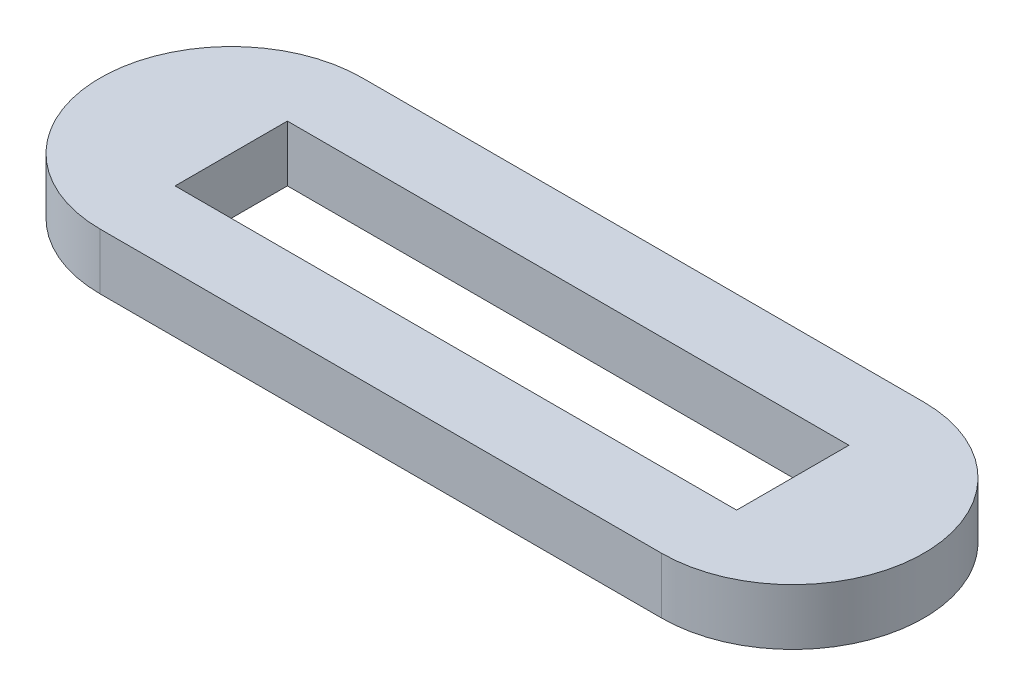
ISO-10303-21;
HEADER;
FILE_DESCRIPTION(('STEP AP214'),'2;1');
FILE_NAME('part.step','',(''),(''),'','','');
FILE_SCHEMA(('AUTOMOTIVE_DESIGN { 1 0 10303 214 1 1 1 1 }'));
ENDSEC;
DATA;
#1=APPLICATION_CONTEXT('core data for automotive mechanical design processes');
#2=APPLICATION_PROTOCOL_DEFINITION('international standard','automotive_design',2000,#1);
#3=PRODUCT_CONTEXT('',#1,'mechanical');
#4=PRODUCT('Part','Part','',(#3));
#5=PRODUCT_RELATED_PRODUCT_CATEGORY('part','',(#4));
#6=PRODUCT_DEFINITION_FORMATION('','',#4);
#7=PRODUCT_DEFINITION_CONTEXT('part definition',#1,'design');
#8=PRODUCT_DEFINITION('design','',#6,#7);
#9=PRODUCT_DEFINITION_SHAPE('','',#8);
#10=(LENGTH_UNIT() NAMED_UNIT(*) SI_UNIT(.MILLI.,.METRE.));
#11=(NAMED_UNIT(*) PLANE_ANGLE_UNIT() SI_UNIT($,.RADIAN.));
#12=(NAMED_UNIT(*) SI_UNIT($,.STERADIAN.) SOLID_ANGLE_UNIT());
#13=UNCERTAINTY_MEASURE_WITH_UNIT(LENGTH_MEASURE(1.E-05),#10,'distance_accuracy_value','');
#14=(GEOMETRIC_REPRESENTATION_CONTEXT(3) GLOBAL_UNCERTAINTY_ASSIGNED_CONTEXT((#13)) GLOBAL_UNIT_ASSIGNED_CONTEXT((#10,
#11,#12)) REPRESENTATION_CONTEXT('',''));
#15=CARTESIAN_POINT('',(0.,0.,0.));
#16=DIRECTION('',(0.,0.,1.));
#17=DIRECTION('',(1.,0.,0.));
#18=AXIS2_PLACEMENT_3D('',#15,#16,#17);
#19=CARTESIAN_POINT('',(-75.0000000000001,15.,0.));
#20=DIRECTION('',(0.,1.,0.));
#21=DIRECTION('',(0.,0.,1.));
#22=AXIS2_PLACEMENT_3D('',#19,#20,#21);
#23=PLANE('',#22);
#24=CARTESIAN_POINT('',(-75.0000000000001,15.,0.));
#25=DIRECTION('',(0.,1.,0.));
#26=DIRECTION('',(0.,0.,1.));
#27=AXIS2_PLACEMENT_3D('',#24,#25,#26);
#28=CIRCLE('',#27,35.);
#29=CARTESIAN_POINT('',(-75.0000000000001,15.,-35.));
#30=VERTEX_POINT('',#29);
#31=CARTESIAN_POINT('',(-75.0000000000001,15.,35.));
#32=VERTEX_POINT('',#31);
#33=EDGE_CURVE('E149',#30,#32,#28,.T.);
#34=ORIENTED_EDGE('',*,*,#33,.T.);
#35=DIRECTION('',(1.,0.,0.));
#36=VECTOR('',#35,1.);
#37=CARTESIAN_POINT('',(-75.0000000000001,15.,35.));
#38=LINE('',#37,#36);
#39=CARTESIAN_POINT('',(74.9999999999999,15.,34.9999999999999));
#40=VERTEX_POINT('',#39);
#41=EDGE_CURVE('E154',#32,#40,#38,.T.);
#42=ORIENTED_EDGE('',*,*,#41,.T.);
#43=CARTESIAN_POINT('',(74.9999999999999,15.,0.));
#44=DIRECTION('',(0.,1.,0.));
#45=DIRECTION('',(0.,0.,1.));
#46=AXIS2_PLACEMENT_3D('',#43,#44,#45);
#47=CIRCLE('',#46,35.);
#48=CARTESIAN_POINT('',(74.9999999999999,15.,-35.));
#49=VERTEX_POINT('',#48);
#50=EDGE_CURVE('E160',#40,#49,#47,.T.);
#51=ORIENTED_EDGE('',*,*,#50,.T.);
#52=DIRECTION('',(-1.,0.,0.));
#53=VECTOR('',#52,1.);
#54=CARTESIAN_POINT('',(-75.0000000000001,15.,-35.));
#55=LINE('',#54,#53);
#56=EDGE_CURVE('E163',#49,#30,#55,.T.);
#57=ORIENTED_EDGE('',*,*,#56,.T.);
#58=EDGE_LOOP('',(#34,#42,#51,#57));
#59=FACE_BOUND('',#58,.T.);
#60=DIRECTION('',(-1.,0.,0.));
#61=VECTOR('',#60,1.);
#62=CARTESIAN_POINT('',(-75.0000000000001,15.,-15.));
#63=LINE('',#62,#61);
#64=CARTESIAN_POINT('',(74.9999999999999,15.,-15.));
#65=VERTEX_POINT('',#64);
#66=CARTESIAN_POINT('',(-75.0000000000001,15.,-15.));
#67=VERTEX_POINT('',#66);
#68=EDGE_CURVE('E109',#65,#67,#63,.T.);
#69=ORIENTED_EDGE('',*,*,#68,.F.);
#70=DIRECTION('',(0.,0.,-1.));
#71=VECTOR('',#70,1.);
#72=CARTESIAN_POINT('',(74.9999999999999,15.,15.));
#73=LINE('',#72,#71);
#74=CARTESIAN_POINT('',(74.9999999999999,15.,15.));
#75=VERTEX_POINT('',#74);
#76=EDGE_CURVE('E100',#75,#65,#73,.T.);
#77=ORIENTED_EDGE('',*,*,#76,.F.);
#78=DIRECTION('',(1.,0.,0.));
#79=VECTOR('',#78,1.);
#80=CARTESIAN_POINT('',(-75.0000000000001,15.,15.));
#81=LINE('',#80,#79);
#82=CARTESIAN_POINT('',(-75.0000000000001,15.,15.));
#83=VERTEX_POINT('',#82);
#84=EDGE_CURVE('E126',#83,#75,#81,.T.);
#85=ORIENTED_EDGE('',*,*,#84,.F.);
#86=DIRECTION('',(0.,0.,1.));
#87=VECTOR('',#86,1.);
#88=CARTESIAN_POINT('',(-75.0000000000001,15.,15.));
#89=LINE('',#88,#87);
#90=EDGE_CURVE('E121',#67,#83,#89,.T.);
#91=ORIENTED_EDGE('',*,*,#90,.F.);
#92=EDGE_LOOP('',(#69,#77,#85,#91));
#93=FACE_BOUND('',#92,.T.);
#94=ADVANCED_FACE('F35',(#59,#93),#23,.T.);
#95=CARTESIAN_POINT('',(-75.0000000000001,0.,0.));
#96=DIRECTION('',(0.,1.,0.));
#97=DIRECTION('',(0.,0.,1.));
#98=AXIS2_PLACEMENT_3D('',#95,#96,#97);
#99=PLANE('',#98);
#100=CARTESIAN_POINT('',(-75.0000000000001,0.,0.));
#101=DIRECTION('',(0.,1.,0.));
#102=DIRECTION('',(0.,0.,1.));
#103=AXIS2_PLACEMENT_3D('',#100,#101,#102);
#104=CIRCLE('',#103,35.);
#105=CARTESIAN_POINT('',(-75.0000000000001,0.,-35.));
#106=VERTEX_POINT('',#105);
#107=CARTESIAN_POINT('',(-75.0000000000001,0.,35.));
#108=VERTEX_POINT('',#107);
#109=EDGE_CURVE('E117',#106,#108,#104,.T.);
#110=ORIENTED_EDGE('',*,*,#109,.F.);
#111=DIRECTION('',(-1.,0.,0.));
#112=VECTOR('',#111,1.);
#113=CARTESIAN_POINT('',(-75.0000000000001,0.,-35.));
#114=LINE('',#113,#112);
#115=CARTESIAN_POINT('',(74.9999999999999,0.,-35.));
#116=VERTEX_POINT('',#115);
#117=EDGE_CURVE('E155',#116,#106,#114,.T.);
#118=ORIENTED_EDGE('',*,*,#117,.F.);
#119=CARTESIAN_POINT('',(74.9999999999999,0.,0.));
#120=DIRECTION('',(0.,1.,0.));
#121=DIRECTION('',(0.,0.,1.));
#122=AXIS2_PLACEMENT_3D('',#119,#120,#121);
#123=CIRCLE('',#122,35.);
#124=CARTESIAN_POINT('',(74.9999999999999,0.,34.9999999999999));
#125=VERTEX_POINT('',#124);
#126=EDGE_CURVE('E171',#125,#116,#123,.T.);
#127=ORIENTED_EDGE('',*,*,#126,.F.);
#128=DIRECTION('',(1.,0.,0.));
#129=VECTOR('',#128,1.);
#130=CARTESIAN_POINT('',(-75.0000000000001,0.,35.));
#131=LINE('',#130,#129);
#132=EDGE_CURVE('E169',#108,#125,#131,.T.);
#133=ORIENTED_EDGE('',*,*,#132,.F.);
#134=EDGE_LOOP('',(#110,#118,#127,#133));
#135=FACE_BOUND('',#134,.T.);
#136=DIRECTION('',(0.,0.,-1.));
#137=VECTOR('',#136,1.);
#138=CARTESIAN_POINT('',(74.9999999999999,0.,15.));
#139=LINE('',#138,#137);
#140=CARTESIAN_POINT('',(74.9999999999999,0.,15.));
#141=VERTEX_POINT('',#140);
#142=CARTESIAN_POINT('',(74.9999999999999,0.,-15.));
#143=VERTEX_POINT('',#142);
#144=EDGE_CURVE('E58',#141,#143,#139,.T.);
#145=ORIENTED_EDGE('',*,*,#144,.T.);
#146=DIRECTION('',(-1.,0.,0.));
#147=VECTOR('',#146,1.);
#148=CARTESIAN_POINT('',(-75.0000000000001,0.,-15.));
#149=LINE('',#148,#147);
#150=CARTESIAN_POINT('',(-75.0000000000001,0.,-15.));
#151=VERTEX_POINT('',#150);
#152=EDGE_CURVE('E116',#143,#151,#149,.T.);
#153=ORIENTED_EDGE('',*,*,#152,.T.);
#154=DIRECTION('',(0.,0.,1.));
#155=VECTOR('',#154,1.);
#156=CARTESIAN_POINT('',(-75.0000000000001,0.,15.));
#157=LINE('',#156,#155);
#158=CARTESIAN_POINT('',(-75.0000000000001,0.,15.));
#159=VERTEX_POINT('',#158);
#160=EDGE_CURVE('E141',#151,#159,#157,.T.);
#161=ORIENTED_EDGE('',*,*,#160,.T.);
#162=DIRECTION('',(1.,0.,0.));
#163=VECTOR('',#162,1.);
#164=CARTESIAN_POINT('',(-75.0000000000001,0.,15.));
#165=LINE('',#164,#163);
#166=EDGE_CURVE('E110',#159,#141,#165,.T.);
#167=ORIENTED_EDGE('',*,*,#166,.T.);
#168=EDGE_LOOP('',(#145,#153,#161,#167));
#169=FACE_BOUND('',#168,.T.);
#170=ADVANCED_FACE('F189',(#135,#169),#99,.F.);
#171=CARTESIAN_POINT('',(-75.0000000000001,15.,0.));
#172=DIRECTION('',(0.,-1.,0.));
#173=DIRECTION('',(0.,0.,-1.));
#174=AXIS2_PLACEMENT_3D('',#171,#172,#173);
#175=CYLINDRICAL_SURFACE('',#174,35.);
#176=ORIENTED_EDGE('',*,*,#109,.T.);
#177=DIRECTION('',(0.,-1.,0.));
#178=VECTOR('',#177,1.);
#179=CARTESIAN_POINT('',(-75.0000000000001,15.,35.));
#180=LINE('',#179,#178);
#181=EDGE_CURVE('E12',#32,#108,#180,.T.);
#182=ORIENTED_EDGE('',*,*,#181,.F.);
#183=ORIENTED_EDGE('',*,*,#33,.F.);
#184=DIRECTION('',(0.,-1.,0.));
#185=VECTOR('',#184,1.);
#186=CARTESIAN_POINT('',(-75.0000000000001,15.,-35.));
#187=LINE('',#186,#185);
#188=EDGE_CURVE('E166',#30,#106,#187,.T.);
#189=ORIENTED_EDGE('',*,*,#188,.T.);
#190=EDGE_LOOP('',(#176,#182,#183,#189));
#191=FACE_BOUND('',#190,.T.);
#192=ADVANCED_FACE('F37',(#191),#175,.T.);
#193=CARTESIAN_POINT('',(-75.0000000000001,15.,35.));
#194=DIRECTION('',(0.,0.,-1.));
#195=DIRECTION('',(-1.,0.,0.));
#196=AXIS2_PLACEMENT_3D('',#193,#194,#195);
#197=PLANE('',#196);
#198=ORIENTED_EDGE('',*,*,#132,.T.);
#199=DIRECTION('',(0.,-1.,0.));
#200=VECTOR('',#199,1.);
#201=CARTESIAN_POINT('',(74.9999999999999,15.,34.9999999999999));
#202=LINE('',#201,#200);
#203=EDGE_CURVE('E43',#40,#125,#202,.T.);
#204=ORIENTED_EDGE('',*,*,#203,.F.);
#205=ORIENTED_EDGE('',*,*,#41,.F.);
#206=ORIENTED_EDGE('',*,*,#181,.T.);
#207=EDGE_LOOP('',(#198,#204,#205,#206));
#208=FACE_BOUND('',#207,.T.);
#209=ADVANCED_FACE('F200',(#208),#197,.F.);
#210=CARTESIAN_POINT('',(74.9999999999999,15.,0.));
#211=DIRECTION('',(0.,-1.,0.));
#212=DIRECTION('',(0.,0.,-1.));
#213=AXIS2_PLACEMENT_3D('',#210,#211,#212);
#214=CYLINDRICAL_SURFACE('',#213,35.);
#215=ORIENTED_EDGE('',*,*,#126,.T.);
#216=DIRECTION('',(0.,-1.,0.));
#217=VECTOR('',#216,1.);
#218=CARTESIAN_POINT('',(74.9999999999999,15.,-35.));
#219=LINE('',#218,#217);
#220=EDGE_CURVE('E176',#49,#116,#219,.T.);
#221=ORIENTED_EDGE('',*,*,#220,.F.);
#222=ORIENTED_EDGE('',*,*,#50,.F.);
#223=ORIENTED_EDGE('',*,*,#203,.T.);
#224=EDGE_LOOP('',(#215,#221,#222,#223));
#225=FACE_BOUND('',#224,.T.);
#226=ADVANCED_FACE('F183',(#225),#214,.T.);
#227=CARTESIAN_POINT('',(-75.0000000000001,15.,-35.));
#228=DIRECTION('',(0.,0.,1.));
#229=DIRECTION('',(1.,0.,0.));
#230=AXIS2_PLACEMENT_3D('',#227,#228,#229);
#231=PLANE('',#230);
#232=ORIENTED_EDGE('',*,*,#117,.T.);
#233=ORIENTED_EDGE('',*,*,#188,.F.);
#234=ORIENTED_EDGE('',*,*,#56,.F.);
#235=ORIENTED_EDGE('',*,*,#220,.T.);
#236=EDGE_LOOP('',(#232,#233,#234,#235));
#237=FACE_BOUND('',#236,.T.);
#238=ADVANCED_FACE('F193',(#237),#231,.F.);
#239=CARTESIAN_POINT('',(74.9999999999999,15.,15.));
#240=DIRECTION('',(-1.,0.,0.));
#241=DIRECTION('',(0.,0.,1.));
#242=AXIS2_PLACEMENT_3D('',#239,#240,#241);
#243=PLANE('',#242);
#244=ORIENTED_EDGE('',*,*,#144,.F.);
#245=DIRECTION('',(0.,-1.,0.));
#246=VECTOR('',#245,1.);
#247=CARTESIAN_POINT('',(74.9999999999999,15.,15.));
#248=LINE('',#247,#246);
#249=EDGE_CURVE('E104',#75,#141,#248,.T.);
#250=ORIENTED_EDGE('',*,*,#249,.F.);
#251=ORIENTED_EDGE('',*,*,#76,.T.);
#252=DIRECTION('',(0.,-1.,0.));
#253=VECTOR('',#252,1.);
#254=CARTESIAN_POINT('',(74.9999999999999,15.,-15.));
#255=LINE('',#254,#253);
#256=EDGE_CURVE('E103',#65,#143,#255,.T.);
#257=ORIENTED_EDGE('',*,*,#256,.T.);
#258=EDGE_LOOP('',(#244,#250,#251,#257));
#259=FACE_BOUND('',#258,.T.);
#260=ADVANCED_FACE('F102',(#259),#243,.T.);
#261=CARTESIAN_POINT('',(-75.0000000000001,15.,-15.));
#262=DIRECTION('',(0.,0.,1.));
#263=DIRECTION('',(1.,0.,0.));
#264=AXIS2_PLACEMENT_3D('',#261,#262,#263);
#265=PLANE('',#264);
#266=ORIENTED_EDGE('',*,*,#152,.F.);
#267=ORIENTED_EDGE('',*,*,#256,.F.);
#268=ORIENTED_EDGE('',*,*,#68,.T.);
#269=DIRECTION('',(0.,-1.,0.));
#270=VECTOR('',#269,1.);
#271=CARTESIAN_POINT('',(-75.0000000000001,15.,-15.));
#272=LINE('',#271,#270);
#273=EDGE_CURVE('E118',#67,#151,#272,.T.);
#274=ORIENTED_EDGE('',*,*,#273,.T.);
#275=EDGE_LOOP('',(#266,#267,#268,#274));
#276=FACE_BOUND('',#275,.T.);
#277=ADVANCED_FACE('F113',(#276),#265,.T.);
#278=CARTESIAN_POINT('',(-75.0000000000001,15.,15.));
#279=DIRECTION('',(1.,0.,0.));
#280=DIRECTION('',(0.,0.,-1.));
#281=AXIS2_PLACEMENT_3D('',#278,#279,#280);
#282=PLANE('',#281);
#283=ORIENTED_EDGE('',*,*,#160,.F.);
#284=ORIENTED_EDGE('',*,*,#273,.F.);
#285=ORIENTED_EDGE('',*,*,#90,.T.);
#286=DIRECTION('',(0.,-1.,0.));
#287=VECTOR('',#286,1.);
#288=CARTESIAN_POINT('',(-75.0000000000001,15.,15.));
#289=LINE('',#288,#287);
#290=EDGE_CURVE('E50',#83,#159,#289,.T.);
#291=ORIENTED_EDGE('',*,*,#290,.T.);
#292=EDGE_LOOP('',(#283,#284,#285,#291));
#293=FACE_BOUND('',#292,.T.);
#294=ADVANCED_FACE('F223',(#293),#282,.T.);
#295=CARTESIAN_POINT('',(-75.0000000000001,15.,15.));
#296=DIRECTION('',(0.,0.,-1.));
#297=DIRECTION('',(-1.,0.,0.));
#298=AXIS2_PLACEMENT_3D('',#295,#296,#297);
#299=PLANE('',#298);
#300=ORIENTED_EDGE('',*,*,#166,.F.);
#301=ORIENTED_EDGE('',*,*,#290,.F.);
#302=ORIENTED_EDGE('',*,*,#84,.T.);
#303=ORIENTED_EDGE('',*,*,#249,.T.);
#304=EDGE_LOOP('',(#300,#301,#302,#303));
#305=FACE_BOUND('',#304,.T.);
#306=ADVANCED_FACE('F227',(#305),#299,.T.);
#307=CLOSED_SHELL('',(#94,#170,#192,#209,#226,#238,#260,#277,#294,#306));
#308=MANIFOLD_SOLID_BREP('B2',#307);
#309=ADVANCED_BREP_SHAPE_REPRESENTATION('',(#18,#308),#14);
#310=SHAPE_DEFINITION_REPRESENTATION(#9,#309);
ENDSEC;
END-ISO-10303-21;
